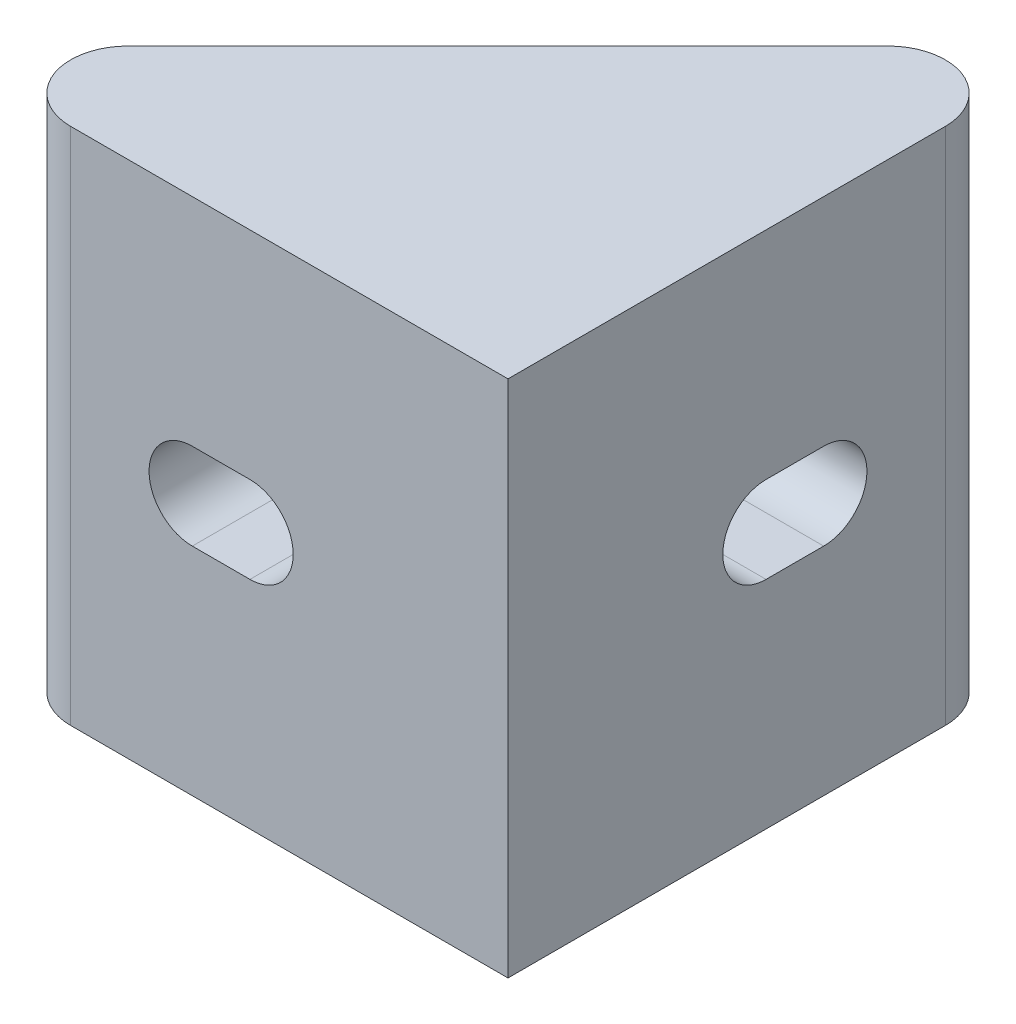
ISO-10303-21;
HEADER;
FILE_DESCRIPTION(('STEP AP214'),'2;1');
FILE_NAME('part.step','',(''),(''),'','','');
FILE_SCHEMA(('AUTOMOTIVE_DESIGN { 1 0 10303 214 1 1 1 1 }'));
ENDSEC;
DATA;
#1=APPLICATION_CONTEXT('core data for automotive mechanical design processes');
#2=APPLICATION_PROTOCOL_DEFINITION('international standard','automotive_design',2000,#1);
#3=PRODUCT_CONTEXT('',#1,'mechanical');
#4=PRODUCT('Part','Part','',(#3));
#5=PRODUCT_RELATED_PRODUCT_CATEGORY('part','',(#4));
#6=PRODUCT_DEFINITION_FORMATION('','',#4);
#7=PRODUCT_DEFINITION_CONTEXT('part definition',#1,'design');
#8=PRODUCT_DEFINITION('design','',#6,#7);
#9=PRODUCT_DEFINITION_SHAPE('','',#8);
#10=(LENGTH_UNIT() NAMED_UNIT(*) SI_UNIT(.MILLI.,.METRE.));
#11=(NAMED_UNIT(*) PLANE_ANGLE_UNIT() SI_UNIT($,.RADIAN.));
#12=(NAMED_UNIT(*) SI_UNIT($,.STERADIAN.) SOLID_ANGLE_UNIT());
#13=UNCERTAINTY_MEASURE_WITH_UNIT(LENGTH_MEASURE(1.E-05),#10,'distance_accuracy_value','');
#14=(GEOMETRIC_REPRESENTATION_CONTEXT(3) GLOBAL_UNCERTAINTY_ASSIGNED_CONTEXT((#13)) GLOBAL_UNIT_ASSIGNED_CONTEXT((#10,
#11,#12)) REPRESENTATION_CONTEXT('',''));
#15=CARTESIAN_POINT('',(0.,0.,0.));
#16=DIRECTION('',(0.,0.,1.));
#17=DIRECTION('',(1.,0.,0.));
#18=AXIS2_PLACEMENT_3D('',#15,#16,#17);
#19=CARTESIAN_POINT('',(0.,16.,0.));
#20=DIRECTION('',(0.,1.,0.));
#21=DIRECTION('',(0.,0.,1.));
#22=AXIS2_PLACEMENT_3D('',#19,#20,#21);
#23=PLANE('',#22);
#24=CARTESIAN_POINT('',(-2.,16.,-15.1715728752538));
#25=DIRECTION('',(0.,1.,0.));
#26=DIRECTION('',(0.,0.,1.));
#27=AXIS2_PLACEMENT_3D('',#24,#25,#26);
#28=CIRCLE('',#27,2.);
#29=CARTESIAN_POINT('',(-3.41421356237313,16.,-16.5857864376269));
#30=VERTEX_POINT('',#29);
#31=CARTESIAN_POINT('',(-3.,16.,-16.9036236828227));
#32=VERTEX_POINT('',#31);
#33=EDGE_CURVE('E247',#30,#32,#28,.F.);
#34=ORIENTED_EDGE('',*,*,#33,.T.);
#35=DIRECTION('',(0.,0.,1.));
#36=VECTOR('',#35,1.);
#37=CARTESIAN_POINT('',(-3.,16.,0.));
#38=LINE('',#37,#36);
#39=CARTESIAN_POINT('',(-3.,16.,-3.));
#40=VERTEX_POINT('',#39);
#41=EDGE_CURVE('E240',#32,#40,#38,.T.);
#42=ORIENTED_EDGE('',*,*,#41,.T.);
#43=DIRECTION('',(-1.,0.,0.));
#44=VECTOR('',#43,1.);
#45=CARTESIAN_POINT('',(0.,16.,-3.));
#46=LINE('',#45,#44);
#47=CARTESIAN_POINT('',(-16.9036236828227,16.,-3.));
#48=VERTEX_POINT('',#47);
#49=EDGE_CURVE('E238',#40,#48,#46,.T.);
#50=ORIENTED_EDGE('',*,*,#49,.T.);
#51=CARTESIAN_POINT('',(-15.1715728752538,16.,-2.));
#52=DIRECTION('',(0.,1.,0.));
#53=DIRECTION('',(0.,0.,1.));
#54=AXIS2_PLACEMENT_3D('',#51,#52,#53);
#55=CIRCLE('',#54,2.);
#56=CARTESIAN_POINT('',(-16.5857864376269,16.,-3.41421356237313));
#57=VERTEX_POINT('',#56);
#58=EDGE_CURVE('E241',#48,#57,#55,.F.);
#59=ORIENTED_EDGE('',*,*,#58,.T.);
#60=DIRECTION('',(0.707106781186548,0.,-0.707106781186548));
#61=VECTOR('',#60,1.);
#62=CARTESIAN_POINT('',(-10.,16.,-10.));
#63=LINE('',#62,#61);
#64=EDGE_CURVE('E237',#57,#30,#63,.T.);
#65=ORIENTED_EDGE('',*,*,#64,.T.);
#66=EDGE_LOOP('',(#34,#42,#50,#59,#65));
#67=FACE_BOUND('',#66,.T.);
#68=ADVANCED_FACE('F33',(#67),#23,.F.);
#69=CARTESIAN_POINT('',(0.,2.,0.));
#70=DIRECTION('',(0.,1.,0.));
#71=DIRECTION('',(0.,0.,1.));
#72=AXIS2_PLACEMENT_3D('',#69,#70,#71);
#73=PLANE('',#72);
#74=DIRECTION('',(0.,0.,1.));
#75=VECTOR('',#74,1.);
#76=CARTESIAN_POINT('',(-3.,2.,0.));
#77=LINE('',#76,#75);
#78=CARTESIAN_POINT('',(-3.,2.,-16.9036236828227));
#79=VERTEX_POINT('',#78);
#80=CARTESIAN_POINT('',(-3.,2.,-3.));
#81=VERTEX_POINT('',#80);
#82=EDGE_CURVE('E233',#79,#81,#77,.T.);
#83=ORIENTED_EDGE('',*,*,#82,.F.);
#84=CARTESIAN_POINT('',(-2.,2.,-15.1715728752538));
#85=DIRECTION('',(0.,1.,0.));
#86=DIRECTION('',(0.,0.,1.));
#87=AXIS2_PLACEMENT_3D('',#84,#85,#86);
#88=CIRCLE('',#87,2.);
#89=CARTESIAN_POINT('',(-3.41421356237313,2.,-16.5857864376269));
#90=VERTEX_POINT('',#89);
#91=EDGE_CURVE('E244',#90,#79,#88,.F.);
#92=ORIENTED_EDGE('',*,*,#91,.F.);
#93=DIRECTION('',(0.707106781186548,0.,-0.707106781186548));
#94=VECTOR('',#93,1.);
#95=CARTESIAN_POINT('',(-10.,2.,-10.));
#96=LINE('',#95,#94);
#97=CARTESIAN_POINT('',(-16.5857864376269,2.,-3.41421356237313));
#98=VERTEX_POINT('',#97);
#99=EDGE_CURVE('E249',#98,#90,#96,.T.);
#100=ORIENTED_EDGE('',*,*,#99,.F.);
#101=CARTESIAN_POINT('',(-15.1715728752538,2.,-2.));
#102=DIRECTION('',(0.,1.,0.));
#103=DIRECTION('',(0.,0.,1.));
#104=AXIS2_PLACEMENT_3D('',#101,#102,#103);
#105=CIRCLE('',#104,2.);
#106=CARTESIAN_POINT('',(-16.9036236828227,2.,-3.));
#107=VERTEX_POINT('',#106);
#108=EDGE_CURVE('E230',#107,#98,#105,.F.);
#109=ORIENTED_EDGE('',*,*,#108,.F.);
#110=DIRECTION('',(-1.,0.,0.));
#111=VECTOR('',#110,1.);
#112=CARTESIAN_POINT('',(0.,2.,-3.));
#113=LINE('',#112,#111);
#114=EDGE_CURVE('E231',#81,#107,#113,.T.);
#115=ORIENTED_EDGE('',*,*,#114,.F.);
#116=EDGE_LOOP('',(#83,#92,#100,#109,#115));
#117=FACE_BOUND('',#116,.T.);
#118=ADVANCED_FACE('F333',(#117),#73,.T.);
#119=CARTESIAN_POINT('',(-10.,18.,-10.));
#120=DIRECTION('',(-0.707106781186547,0.,-0.707106781186547));
#121=DIRECTION('',(-0.707106781186548,0.,0.707106781186548));
#122=AXIS2_PLACEMENT_3D('',#119,#120,#121);
#123=PLANE('',#122);
#124=DIRECTION('',(0.,-1.,0.));
#125=VECTOR('',#124,1.);
#126=CARTESIAN_POINT('',(-16.5857864376269,18.,-3.41421356237313));
#127=LINE('',#126,#125);
#128=CARTESIAN_POINT('',(-16.5857864376269,0.,-3.41421356237313));
#129=VERTEX_POINT('',#128);
#130=EDGE_CURVE('E272',#98,#129,#127,.T.);
#131=ORIENTED_EDGE('',*,*,#130,.F.);
#132=ORIENTED_EDGE('',*,*,#99,.T.);
#133=DIRECTION('',(0.,-1.,0.));
#134=VECTOR('',#133,1.);
#135=CARTESIAN_POINT('',(-3.41421356237313,18.,-16.5857864376269));
#136=LINE('',#135,#134);
#137=CARTESIAN_POINT('',(-3.41421356237313,0.,-16.5857864376269));
#138=VERTEX_POINT('',#137);
#139=EDGE_CURVE('E287',#90,#138,#136,.T.);
#140=ORIENTED_EDGE('',*,*,#139,.T.);
#141=DIRECTION('',(0.707106781186548,0.,-0.707106781186548));
#142=VECTOR('',#141,1.);
#143=CARTESIAN_POINT('',(-10.,0.,-10.));
#144=LINE('',#143,#142);
#145=EDGE_CURVE('E261',#129,#138,#144,.T.);
#146=ORIENTED_EDGE('',*,*,#145,.F.);
#147=EDGE_LOOP('',(#131,#132,#140,#146));
#148=FACE_BOUND('',#147,.T.);
#149=ADVANCED_FACE('F336',(#148),#123,.T.);
#150=CARTESIAN_POINT('',(-15.1715728752538,18.,-2.));
#151=DIRECTION('',(0.,-1.,0.));
#152=DIRECTION('',(0.,0.,-1.));
#153=AXIS2_PLACEMENT_3D('',#150,#151,#152);
#154=CYLINDRICAL_SURFACE('',#153,2.);
#155=CARTESIAN_POINT('',(-15.1715728752538,18.,-2.));
#156=DIRECTION('',(0.,1.,0.));
#157=DIRECTION('',(0.,0.,1.));
#158=AXIS2_PLACEMENT_3D('',#155,#156,#157);
#159=CIRCLE('',#158,2.);
#160=CARTESIAN_POINT('',(-15.1715728752538,18.,0.));
#161=VERTEX_POINT('',#160);
#162=CARTESIAN_POINT('',(-16.5857864376269,18.,-3.41421356237313));
#163=VERTEX_POINT('',#162);
#164=EDGE_CURVE('E258',#161,#163,#159,.F.);
#165=ORIENTED_EDGE('',*,*,#164,.T.);
#166=EDGE_CURVE('E284',#163,#57,#127,.T.);
#167=ORIENTED_EDGE('',*,*,#166,.T.);
#168=ORIENTED_EDGE('',*,*,#58,.F.);
#169=DIRECTION('',(0.,-1.,0.));
#170=VECTOR('',#169,1.);
#171=CARTESIAN_POINT('',(-16.9036236828227,18.,-3.));
#172=LINE('',#171,#170);
#173=EDGE_CURVE('E224',#48,#107,#172,.T.);
#174=ORIENTED_EDGE('',*,*,#173,.T.);
#175=ORIENTED_EDGE('',*,*,#108,.T.);
#176=ORIENTED_EDGE('',*,*,#130,.T.);
#177=CARTESIAN_POINT('',(-15.1715728752538,0.,-2.));
#178=DIRECTION('',(0.,1.,0.));
#179=DIRECTION('',(0.,0.,1.));
#180=AXIS2_PLACEMENT_3D('',#177,#178,#179);
#181=CIRCLE('',#180,2.);
#182=CARTESIAN_POINT('',(-15.1715728752538,0.,0.));
#183=VERTEX_POINT('',#182);
#184=EDGE_CURVE('E236',#183,#129,#181,.F.);
#185=ORIENTED_EDGE('',*,*,#184,.F.);
#186=DIRECTION('',(0.,-1.,0.));
#187=VECTOR('',#186,1.);
#188=CARTESIAN_POINT('',(-15.1715728752538,18.,0.));
#189=LINE('',#188,#187);
#190=EDGE_CURVE('E11',#161,#183,#189,.T.);
#191=ORIENTED_EDGE('',*,*,#190,.F.);
#192=EDGE_LOOP('',(#165,#167,#168,#174,#175,#176,#185,#191));
#193=FACE_BOUND('',#192,.T.);
#194=ADVANCED_FACE('F35',(#193),#154,.T.);
#195=CARTESIAN_POINT('',(0.,18.,0.));
#196=DIRECTION('',(0.,0.,1.));
#197=DIRECTION('',(1.,0.,0.));
#198=AXIS2_PLACEMENT_3D('',#195,#196,#197);
#199=PLANE('',#198);
#200=CARTESIAN_POINT('',(-8.95181184141134,9.,0.));
#201=DIRECTION('',(0.,0.,1.));
#202=DIRECTION('',(1.,0.,0.));
#203=AXIS2_PLACEMENT_3D('',#200,#201,#202);
#204=CIRCLE('',#203,1.5);
#205=CARTESIAN_POINT('',(-8.95181184141134,7.5,0.));
#206=VERTEX_POINT('',#205);
#207=CARTESIAN_POINT('',(-8.95181184141134,10.5,0.));
#208=VERTEX_POINT('',#207);
#209=EDGE_CURVE('E201',#206,#208,#204,.T.);
#210=ORIENTED_EDGE('',*,*,#209,.F.);
#211=DIRECTION('',(1.,0.,0.));
#212=VECTOR('',#211,1.);
#213=CARTESIAN_POINT('',(-8.95181184141134,7.5,0.));
#214=LINE('',#213,#212);
#215=CARTESIAN_POINT('',(-10.9518118414113,7.5,0.));
#216=VERTEX_POINT('',#215);
#217=EDGE_CURVE('E209',#216,#206,#214,.T.);
#218=ORIENTED_EDGE('',*,*,#217,.F.);
#219=CARTESIAN_POINT('',(-10.9518118414113,9.,0.));
#220=DIRECTION('',(0.,0.,1.));
#221=DIRECTION('',(1.,0.,0.));
#222=AXIS2_PLACEMENT_3D('',#219,#220,#221);
#223=CIRCLE('',#222,1.5);
#224=CARTESIAN_POINT('',(-10.9518118414113,10.5,0.));
#225=VERTEX_POINT('',#224);
#226=EDGE_CURVE('E206',#225,#216,#223,.T.);
#227=ORIENTED_EDGE('',*,*,#226,.F.);
#228=DIRECTION('',(-1.,0.,0.));
#229=VECTOR('',#228,1.);
#230=CARTESIAN_POINT('',(-8.95181184141134,10.5,0.));
#231=LINE('',#230,#229);
#232=EDGE_CURVE('E203',#208,#225,#231,.T.);
#233=ORIENTED_EDGE('',*,*,#232,.F.);
#234=EDGE_LOOP('',(#210,#218,#227,#233));
#235=FACE_BOUND('',#234,.T.);
#236=DIRECTION('',(-1.,0.,0.));
#237=VECTOR('',#236,1.);
#238=CARTESIAN_POINT('',(0.,0.,0.));
#239=LINE('',#238,#237);
#240=CARTESIAN_POINT('',(0.,0.,0.));
#241=VERTEX_POINT('',#240);
#242=EDGE_CURVE('E274',#241,#183,#239,.T.);
#243=ORIENTED_EDGE('',*,*,#242,.F.);
#244=DIRECTION('',(0.,-1.,0.));
#245=VECTOR('',#244,1.);
#246=CARTESIAN_POINT('',(0.,18.,0.));
#247=LINE('',#246,#245);
#248=CARTESIAN_POINT('',(0.,18.,0.));
#249=VERTEX_POINT('',#248);
#250=EDGE_CURVE('E41',#249,#241,#247,.T.);
#251=ORIENTED_EDGE('',*,*,#250,.F.);
#252=DIRECTION('',(-1.,0.,0.));
#253=VECTOR('',#252,1.);
#254=CARTESIAN_POINT('',(0.,18.,0.));
#255=LINE('',#254,#253);
#256=EDGE_CURVE('E260',#249,#161,#255,.T.);
#257=ORIENTED_EDGE('',*,*,#256,.T.);
#258=ORIENTED_EDGE('',*,*,#190,.T.);
#259=EDGE_LOOP('',(#243,#251,#257,#258));
#260=FACE_BOUND('',#259,.T.);
#261=ADVANCED_FACE('F301',(#235,#260),#199,.T.);
#262=CARTESIAN_POINT('',(0.,18.,0.));
#263=DIRECTION('',(1.,0.,0.));
#264=DIRECTION('',(0.,0.,-1.));
#265=AXIS2_PLACEMENT_3D('',#262,#263,#264);
#266=PLANE('',#265);
#267=CARTESIAN_POINT('',(0.,9.,-10.9518118414113));
#268=DIRECTION('',(1.,0.,0.));
#269=DIRECTION('',(0.,0.,-1.));
#270=AXIS2_PLACEMENT_3D('',#267,#268,#269);
#271=CIRCLE('',#270,1.5);
#272=CARTESIAN_POINT('',(0.,7.5,-10.9518118414113));
#273=VERTEX_POINT('',#272);
#274=CARTESIAN_POINT('',(0.,10.5,-10.9518118414113));
#275=VERTEX_POINT('',#274);
#276=EDGE_CURVE('E48',#273,#275,#271,.T.);
#277=ORIENTED_EDGE('',*,*,#276,.F.);
#278=DIRECTION('',(0.,0.,-1.));
#279=VECTOR('',#278,1.);
#280=CARTESIAN_POINT('',(0.,7.5,-10.9518118414113));
#281=LINE('',#280,#279);
#282=CARTESIAN_POINT('',(0.,7.5,-8.95181184141134));
#283=VERTEX_POINT('',#282);
#284=EDGE_CURVE('E165',#283,#273,#281,.T.);
#285=ORIENTED_EDGE('',*,*,#284,.F.);
#286=CARTESIAN_POINT('',(0.,9.,-8.95181184141134));
#287=DIRECTION('',(1.,0.,0.));
#288=DIRECTION('',(0.,0.,-1.));
#289=AXIS2_PLACEMENT_3D('',#286,#287,#288);
#290=CIRCLE('',#289,1.5);
#291=CARTESIAN_POINT('',(0.,10.5,-8.95181184141134));
#292=VERTEX_POINT('',#291);
#293=EDGE_CURVE('E185',#292,#283,#290,.T.);
#294=ORIENTED_EDGE('',*,*,#293,.F.);
#295=DIRECTION('',(0.,0.,1.));
#296=VECTOR('',#295,1.);
#297=CARTESIAN_POINT('',(0.,10.5,-10.9518118414113));
#298=LINE('',#297,#296);
#299=EDGE_CURVE('E179',#275,#292,#298,.T.);
#300=ORIENTED_EDGE('',*,*,#299,.F.);
#301=EDGE_LOOP('',(#277,#285,#294,#300));
#302=FACE_BOUND('',#301,.T.);
#303=DIRECTION('',(0.,0.,1.));
#304=VECTOR('',#303,1.);
#305=CARTESIAN_POINT('',(0.,0.,0.));
#306=LINE('',#305,#304);
#307=CARTESIAN_POINT('',(0.,0.,-15.1715728752538));
#308=VERTEX_POINT('',#307);
#309=EDGE_CURVE('E277',#308,#241,#306,.T.);
#310=ORIENTED_EDGE('',*,*,#309,.F.);
#311=DIRECTION('',(0.,-1.,0.));
#312=VECTOR('',#311,1.);
#313=CARTESIAN_POINT('',(0.,18.,-15.1715728752538));
#314=LINE('',#313,#312);
#315=CARTESIAN_POINT('',(0.,18.,-15.1715728752538));
#316=VERTEX_POINT('',#315);
#317=EDGE_CURVE('E291',#316,#308,#314,.T.);
#318=ORIENTED_EDGE('',*,*,#317,.F.);
#319=DIRECTION('',(0.,0.,1.));
#320=VECTOR('',#319,1.);
#321=CARTESIAN_POINT('',(0.,18.,0.));
#322=LINE('',#321,#320);
#323=EDGE_CURVE('E264',#316,#249,#322,.T.);
#324=ORIENTED_EDGE('',*,*,#323,.T.);
#325=ORIENTED_EDGE('',*,*,#250,.T.);
#326=EDGE_LOOP('',(#310,#318,#324,#325));
#327=FACE_BOUND('',#326,.T.);
#328=ADVANCED_FACE('F296',(#302,#327),#266,.T.);
#329=CARTESIAN_POINT('',(-2.,18.,-15.1715728752538));
#330=DIRECTION('',(0.,-1.,0.));
#331=DIRECTION('',(0.,0.,-1.));
#332=AXIS2_PLACEMENT_3D('',#329,#330,#331);
#333=CYLINDRICAL_SURFACE('',#332,2.);
#334=DIRECTION('',(0.,-1.,0.));
#335=VECTOR('',#334,1.);
#336=CARTESIAN_POINT('',(-3.,18.,-16.9036236828227));
#337=LINE('',#336,#335);
#338=EDGE_CURVE('E227',#32,#79,#337,.T.);
#339=ORIENTED_EDGE('',*,*,#338,.F.);
#340=ORIENTED_EDGE('',*,*,#33,.F.);
#341=CARTESIAN_POINT('',(-3.41421356237313,18.,-16.5857864376269));
#342=VERTEX_POINT('',#341);
#343=EDGE_CURVE('E288',#342,#30,#136,.T.);
#344=ORIENTED_EDGE('',*,*,#343,.F.);
#345=CARTESIAN_POINT('',(-2.,18.,-15.1715728752538));
#346=DIRECTION('',(0.,1.,0.));
#347=DIRECTION('',(0.,0.,1.));
#348=AXIS2_PLACEMENT_3D('',#345,#346,#347);
#349=CIRCLE('',#348,2.);
#350=EDGE_CURVE('E267',#342,#316,#349,.F.);
#351=ORIENTED_EDGE('',*,*,#350,.T.);
#352=ORIENTED_EDGE('',*,*,#317,.T.);
#353=CARTESIAN_POINT('',(-2.,0.,-15.1715728752538));
#354=DIRECTION('',(0.,1.,0.));
#355=DIRECTION('',(0.,0.,1.));
#356=AXIS2_PLACEMENT_3D('',#353,#354,#355);
#357=CIRCLE('',#356,2.);
#358=EDGE_CURVE('E280',#138,#308,#357,.F.);
#359=ORIENTED_EDGE('',*,*,#358,.F.);
#360=ORIENTED_EDGE('',*,*,#139,.F.);
#361=ORIENTED_EDGE('',*,*,#91,.T.);
#362=EDGE_LOOP('',(#339,#340,#344,#351,#352,#359,#360,#361));
#363=FACE_BOUND('',#362,.T.);
#364=ADVANCED_FACE('F310',(#363),#333,.T.);
#365=ORIENTED_EDGE('',*,*,#64,.F.);
#366=ORIENTED_EDGE('',*,*,#166,.F.);
#367=DIRECTION('',(0.707106781186548,0.,-0.707106781186548));
#368=VECTOR('',#367,1.);
#369=CARTESIAN_POINT('',(-10.,18.,-10.));
#370=LINE('',#369,#368);
#371=EDGE_CURVE('E269',#163,#342,#370,.T.);
#372=ORIENTED_EDGE('',*,*,#371,.T.);
#373=ORIENTED_EDGE('',*,*,#343,.T.);
#374=EDGE_LOOP('',(#365,#366,#372,#373));
#375=FACE_BOUND('',#374,.T.);
#376=ADVANCED_FACE('F321',(#375),#123,.T.);
#377=CARTESIAN_POINT('',(0.,18.,0.));
#378=DIRECTION('',(0.,1.,0.));
#379=DIRECTION('',(0.,0.,1.));
#380=AXIS2_PLACEMENT_3D('',#377,#378,#379);
#381=PLANE('',#380);
#382=ORIENTED_EDGE('',*,*,#323,.F.);
#383=ORIENTED_EDGE('',*,*,#350,.F.);
#384=ORIENTED_EDGE('',*,*,#371,.F.);
#385=ORIENTED_EDGE('',*,*,#164,.F.);
#386=ORIENTED_EDGE('',*,*,#256,.F.);
#387=EDGE_LOOP('',(#382,#383,#384,#385,#386));
#388=FACE_BOUND('',#387,.T.);
#389=ADVANCED_FACE('F313',(#388),#381,.T.);
#390=CARTESIAN_POINT('',(0.,0.,0.));
#391=DIRECTION('',(0.,1.,0.));
#392=DIRECTION('',(0.,0.,1.));
#393=AXIS2_PLACEMENT_3D('',#390,#391,#392);
#394=PLANE('',#393);
#395=ORIENTED_EDGE('',*,*,#358,.T.);
#396=ORIENTED_EDGE('',*,*,#309,.T.);
#397=ORIENTED_EDGE('',*,*,#242,.T.);
#398=ORIENTED_EDGE('',*,*,#184,.T.);
#399=ORIENTED_EDGE('',*,*,#145,.T.);
#400=EDGE_LOOP('',(#395,#396,#397,#398,#399));
#401=FACE_BOUND('',#400,.T.);
#402=ADVANCED_FACE('F304',(#401),#394,.F.);
#403=CARTESIAN_POINT('',(0.,18.,-3.));
#404=DIRECTION('',(0.,0.,1.));
#405=DIRECTION('',(1.,0.,0.));
#406=AXIS2_PLACEMENT_3D('',#403,#404,#405);
#407=PLANE('',#406);
#408=DIRECTION('',(-1.,0.,0.));
#409=VECTOR('',#408,1.);
#410=CARTESIAN_POINT('',(-8.95181184141134,7.5,-3.));
#411=LINE('',#410,#409);
#412=CARTESIAN_POINT('',(-8.95181184141134,7.5,-3.));
#413=VERTEX_POINT('',#412);
#414=CARTESIAN_POINT('',(-10.9518118414113,7.5,-3.));
#415=VERTEX_POINT('',#414);
#416=EDGE_CURVE('E195',#413,#415,#411,.T.);
#417=ORIENTED_EDGE('',*,*,#416,.F.);
#418=CARTESIAN_POINT('',(-8.95181184141134,9.,-3.));
#419=DIRECTION('',(0.,0.,1.));
#420=DIRECTION('',(1.,0.,0.));
#421=AXIS2_PLACEMENT_3D('',#418,#419,#420);
#422=CIRCLE('',#421,1.5);
#423=CARTESIAN_POINT('',(-8.95181184141134,10.5,-3.));
#424=VERTEX_POINT('',#423);
#425=EDGE_CURVE('E198',#424,#413,#422,.F.);
#426=ORIENTED_EDGE('',*,*,#425,.F.);
#427=DIRECTION('',(1.,0.,0.));
#428=VECTOR('',#427,1.);
#429=CARTESIAN_POINT('',(-8.95181184141134,10.5,-3.));
#430=LINE('',#429,#428);
#431=CARTESIAN_POINT('',(-10.9518118414113,10.5,-3.));
#432=VERTEX_POINT('',#431);
#433=EDGE_CURVE('E215',#432,#424,#430,.T.);
#434=ORIENTED_EDGE('',*,*,#433,.F.);
#435=CARTESIAN_POINT('',(-10.9518118414113,9.,-3.));
#436=DIRECTION('',(0.,0.,1.));
#437=DIRECTION('',(1.,0.,0.));
#438=AXIS2_PLACEMENT_3D('',#435,#436,#437);
#439=CIRCLE('',#438,1.5);
#440=EDGE_CURVE('E171',#415,#432,#439,.F.);
#441=ORIENTED_EDGE('',*,*,#440,.F.);
#442=EDGE_LOOP('',(#417,#426,#434,#441));
#443=FACE_BOUND('',#442,.T.);
#444=ORIENTED_EDGE('',*,*,#114,.T.);
#445=ORIENTED_EDGE('',*,*,#173,.F.);
#446=ORIENTED_EDGE('',*,*,#49,.F.);
#447=DIRECTION('',(0.,-1.,0.));
#448=VECTOR('',#447,1.);
#449=CARTESIAN_POINT('',(-3.,18.,-3.));
#450=LINE('',#449,#448);
#451=EDGE_CURVE('E234',#40,#81,#450,.T.);
#452=ORIENTED_EDGE('',*,*,#451,.T.);
#453=EDGE_LOOP('',(#444,#445,#446,#452));
#454=FACE_BOUND('',#453,.T.);
#455=ADVANCED_FACE('F327',(#443,#454),#407,.F.);
#456=CARTESIAN_POINT('',(-3.,18.,0.));
#457=DIRECTION('',(1.,0.,0.));
#458=DIRECTION('',(0.,0.,-1.));
#459=AXIS2_PLACEMENT_3D('',#456,#457,#458);
#460=PLANE('',#459);
#461=DIRECTION('',(0.,0.,1.));
#462=VECTOR('',#461,1.);
#463=CARTESIAN_POINT('',(-3.,7.5,-10.9518118414113));
#464=LINE('',#463,#462);
#465=CARTESIAN_POINT('',(-3.,7.5,-10.9518118414113));
#466=VERTEX_POINT('',#465);
#467=CARTESIAN_POINT('',(-3.,7.5,-8.95181184141134));
#468=VERTEX_POINT('',#467);
#469=EDGE_CURVE('E177',#466,#468,#464,.T.);
#470=ORIENTED_EDGE('',*,*,#469,.F.);
#471=CARTESIAN_POINT('',(-3.,9.,-10.9518118414113));
#472=DIRECTION('',(1.,0.,0.));
#473=DIRECTION('',(0.,0.,-1.));
#474=AXIS2_PLACEMENT_3D('',#471,#472,#473);
#475=CIRCLE('',#474,1.5);
#476=CARTESIAN_POINT('',(-3.,10.5,-10.9518118414113));
#477=VERTEX_POINT('',#476);
#478=EDGE_CURVE('E159',#477,#466,#475,.F.);
#479=ORIENTED_EDGE('',*,*,#478,.F.);
#480=DIRECTION('',(0.,0.,-1.));
#481=VECTOR('',#480,1.);
#482=CARTESIAN_POINT('',(-3.,10.5,-10.9518118414113));
#483=LINE('',#482,#481);
#484=CARTESIAN_POINT('',(-3.,10.5,-8.95181184141134));
#485=VERTEX_POINT('',#484);
#486=EDGE_CURVE('E168',#485,#477,#483,.T.);
#487=ORIENTED_EDGE('',*,*,#486,.F.);
#488=CARTESIAN_POINT('',(-3.,9.,-8.95181184141134));
#489=DIRECTION('',(1.,0.,0.));
#490=DIRECTION('',(0.,0.,-1.));
#491=AXIS2_PLACEMENT_3D('',#488,#489,#490);
#492=CIRCLE('',#491,1.5);
#493=EDGE_CURVE('E56',#468,#485,#492,.F.);
#494=ORIENTED_EDGE('',*,*,#493,.F.);
#495=EDGE_LOOP('',(#470,#479,#487,#494));
#496=FACE_BOUND('',#495,.T.);
#497=ORIENTED_EDGE('',*,*,#82,.T.);
#498=ORIENTED_EDGE('',*,*,#451,.F.);
#499=ORIENTED_EDGE('',*,*,#41,.F.);
#500=ORIENTED_EDGE('',*,*,#338,.T.);
#501=EDGE_LOOP('',(#497,#498,#499,#500));
#502=FACE_BOUND('',#501,.T.);
#503=ADVANCED_FACE('F174',(#496,#502),#460,.F.);
#504=CARTESIAN_POINT('',(-8.95181184141134,9.,-17.1725728752538));
#505=DIRECTION('',(0.,0.,1.));
#506=DIRECTION('',(1.,0.,0.));
#507=AXIS2_PLACEMENT_3D('',#504,#505,#506);
#508=CYLINDRICAL_SURFACE('',#507,1.5);
#509=ORIENTED_EDGE('',*,*,#425,.T.);
#510=DIRECTION('',(0.,0.,1.));
#511=VECTOR('',#510,1.);
#512=CARTESIAN_POINT('',(-8.95181184141134,7.5,-17.1725728752538));
#513=LINE('',#512,#511);
#514=EDGE_CURVE('E213',#413,#206,#513,.T.);
#515=ORIENTED_EDGE('',*,*,#514,.T.);
#516=ORIENTED_EDGE('',*,*,#209,.T.);
#517=DIRECTION('',(0.,0.,1.));
#518=VECTOR('',#517,1.);
#519=CARTESIAN_POINT('',(-8.95181184141134,10.5,-17.1725728752538));
#520=LINE('',#519,#518);
#521=EDGE_CURVE('E212',#424,#208,#520,.T.);
#522=ORIENTED_EDGE('',*,*,#521,.F.);
#523=EDGE_LOOP('',(#509,#515,#516,#522));
#524=FACE_BOUND('',#523,.T.);
#525=ADVANCED_FACE('F363',(#524),#508,.F.);
#526=CARTESIAN_POINT('',(-8.95181184141134,7.5,-17.1725728752538));
#527=DIRECTION('',(0.,-1.,0.));
#528=DIRECTION('',(1.,0.,0.));
#529=AXIS2_PLACEMENT_3D('',#526,#527,#528);
#530=PLANE('',#529);
#531=ORIENTED_EDGE('',*,*,#416,.T.);
#532=DIRECTION('',(0.,0.,1.));
#533=VECTOR('',#532,1.);
#534=CARTESIAN_POINT('',(-10.9518118414113,7.5,-17.1725728752538));
#535=LINE('',#534,#533);
#536=EDGE_CURVE('E216',#415,#216,#535,.T.);
#537=ORIENTED_EDGE('',*,*,#536,.T.);
#538=ORIENTED_EDGE('',*,*,#217,.T.);
#539=ORIENTED_EDGE('',*,*,#514,.F.);
#540=EDGE_LOOP('',(#531,#537,#538,#539));
#541=FACE_BOUND('',#540,.T.);
#542=ADVANCED_FACE('F368',(#541),#530,.F.);
#543=CARTESIAN_POINT('',(-10.9518118414113,9.,-17.1725728752538));
#544=DIRECTION('',(0.,0.,1.));
#545=DIRECTION('',(1.,0.,0.));
#546=AXIS2_PLACEMENT_3D('',#543,#544,#545);
#547=CYLINDRICAL_SURFACE('',#546,1.5);
#548=ORIENTED_EDGE('',*,*,#440,.T.);
#549=DIRECTION('',(0.,0.,1.));
#550=VECTOR('',#549,1.);
#551=CARTESIAN_POINT('',(-10.9518118414113,10.5,-17.1725728752538));
#552=LINE('',#551,#550);
#553=EDGE_CURVE('E218',#432,#225,#552,.T.);
#554=ORIENTED_EDGE('',*,*,#553,.T.);
#555=ORIENTED_EDGE('',*,*,#226,.T.);
#556=ORIENTED_EDGE('',*,*,#536,.F.);
#557=EDGE_LOOP('',(#548,#554,#555,#556));
#558=FACE_BOUND('',#557,.T.);
#559=ADVANCED_FACE('F373',(#558),#547,.F.);
#560=CARTESIAN_POINT('',(-8.95181184141134,10.5,-17.1725728752538));
#561=DIRECTION('',(0.,1.,0.));
#562=DIRECTION('',(0.,0.,1.));
#563=AXIS2_PLACEMENT_3D('',#560,#561,#562);
#564=PLANE('',#563);
#565=ORIENTED_EDGE('',*,*,#433,.T.);
#566=ORIENTED_EDGE('',*,*,#521,.T.);
#567=ORIENTED_EDGE('',*,*,#232,.T.);
#568=ORIENTED_EDGE('',*,*,#553,.F.);
#569=EDGE_LOOP('',(#565,#566,#567,#568));
#570=FACE_BOUND('',#569,.T.);
#571=ADVANCED_FACE('F370',(#570),#564,.F.);
#572=CARTESIAN_POINT('',(-17.1725728752538,9.,-10.9518118414113));
#573=DIRECTION('',(1.,0.,0.));
#574=DIRECTION('',(0.,0.,-1.));
#575=AXIS2_PLACEMENT_3D('',#572,#573,#574);
#576=CYLINDRICAL_SURFACE('',#575,1.5);
#577=ORIENTED_EDGE('',*,*,#478,.T.);
#578=DIRECTION('',(1.,0.,0.));
#579=VECTOR('',#578,1.);
#580=CARTESIAN_POINT('',(-17.1725728752538,7.5,-10.9518118414113));
#581=LINE('',#580,#579);
#582=EDGE_CURVE('E172',#466,#273,#581,.T.);
#583=ORIENTED_EDGE('',*,*,#582,.T.);
#584=ORIENTED_EDGE('',*,*,#276,.T.);
#585=DIRECTION('',(1.,0.,0.));
#586=VECTOR('',#585,1.);
#587=CARTESIAN_POINT('',(-17.1725728752538,10.5,-10.9518118414113));
#588=LINE('',#587,#586);
#589=EDGE_CURVE('E155',#477,#275,#588,.T.);
#590=ORIENTED_EDGE('',*,*,#589,.F.);
#591=EDGE_LOOP('',(#577,#583,#584,#590));
#592=FACE_BOUND('',#591,.T.);
#593=ADVANCED_FACE('F157',(#592),#576,.F.);
#594=CARTESIAN_POINT('',(-17.1725728752538,7.5,-10.9518118414113));
#595=DIRECTION('',(0.,-1.,0.));
#596=DIRECTION('',(0.,0.,-1.));
#597=AXIS2_PLACEMENT_3D('',#594,#595,#596);
#598=PLANE('',#597);
#599=ORIENTED_EDGE('',*,*,#469,.T.);
#600=DIRECTION('',(1.,0.,0.));
#601=VECTOR('',#600,1.);
#602=CARTESIAN_POINT('',(-17.1725728752538,7.5,-8.95181184141134));
#603=LINE('',#602,#601);
#604=EDGE_CURVE('E191',#468,#283,#603,.T.);
#605=ORIENTED_EDGE('',*,*,#604,.T.);
#606=ORIENTED_EDGE('',*,*,#284,.T.);
#607=ORIENTED_EDGE('',*,*,#582,.F.);
#608=EDGE_LOOP('',(#599,#605,#606,#607));
#609=FACE_BOUND('',#608,.T.);
#610=ADVANCED_FACE('F383',(#609),#598,.F.);
#611=CARTESIAN_POINT('',(-17.1725728752538,9.,-8.95181184141134));
#612=DIRECTION('',(1.,0.,0.));
#613=DIRECTION('',(0.,0.,-1.));
#614=AXIS2_PLACEMENT_3D('',#611,#612,#613);
#615=CYLINDRICAL_SURFACE('',#614,1.5);
#616=ORIENTED_EDGE('',*,*,#493,.T.);
#617=DIRECTION('',(1.,0.,0.));
#618=VECTOR('',#617,1.);
#619=CARTESIAN_POINT('',(-17.1725728752538,10.5,-8.95181184141134));
#620=LINE('',#619,#618);
#621=EDGE_CURVE('E164',#485,#292,#620,.T.);
#622=ORIENTED_EDGE('',*,*,#621,.T.);
#623=ORIENTED_EDGE('',*,*,#293,.T.);
#624=ORIENTED_EDGE('',*,*,#604,.F.);
#625=EDGE_LOOP('',(#616,#622,#623,#624));
#626=FACE_BOUND('',#625,.T.);
#627=ADVANCED_FACE('F386',(#626),#615,.F.);
#628=CARTESIAN_POINT('',(-17.1725728752538,10.5,-10.9518118414113));
#629=DIRECTION('',(0.,1.,0.));
#630=DIRECTION('',(0.,0.,1.));
#631=AXIS2_PLACEMENT_3D('',#628,#629,#630);
#632=PLANE('',#631);
#633=ORIENTED_EDGE('',*,*,#486,.T.);
#634=ORIENTED_EDGE('',*,*,#589,.T.);
#635=ORIENTED_EDGE('',*,*,#299,.T.);
#636=ORIENTED_EDGE('',*,*,#621,.F.);
#637=EDGE_LOOP('',(#633,#634,#635,#636));
#638=FACE_BOUND('',#637,.T.);
#639=ADVANCED_FACE('F169',(#638),#632,.F.);
#640=CLOSED_SHELL('',(#68,#118,#149,#194,#261,#328,#364,#376,#389,#402,#455,#503,#525,#542,#559,
#571,#593,#610,#627,#639));
#641=MANIFOLD_SOLID_BREP('B2',#640);
#642=ADVANCED_BREP_SHAPE_REPRESENTATION('',(#18,#641),#14);
#643=SHAPE_DEFINITION_REPRESENTATION(#9,#642);
ENDSEC;
END-ISO-10303-21;
